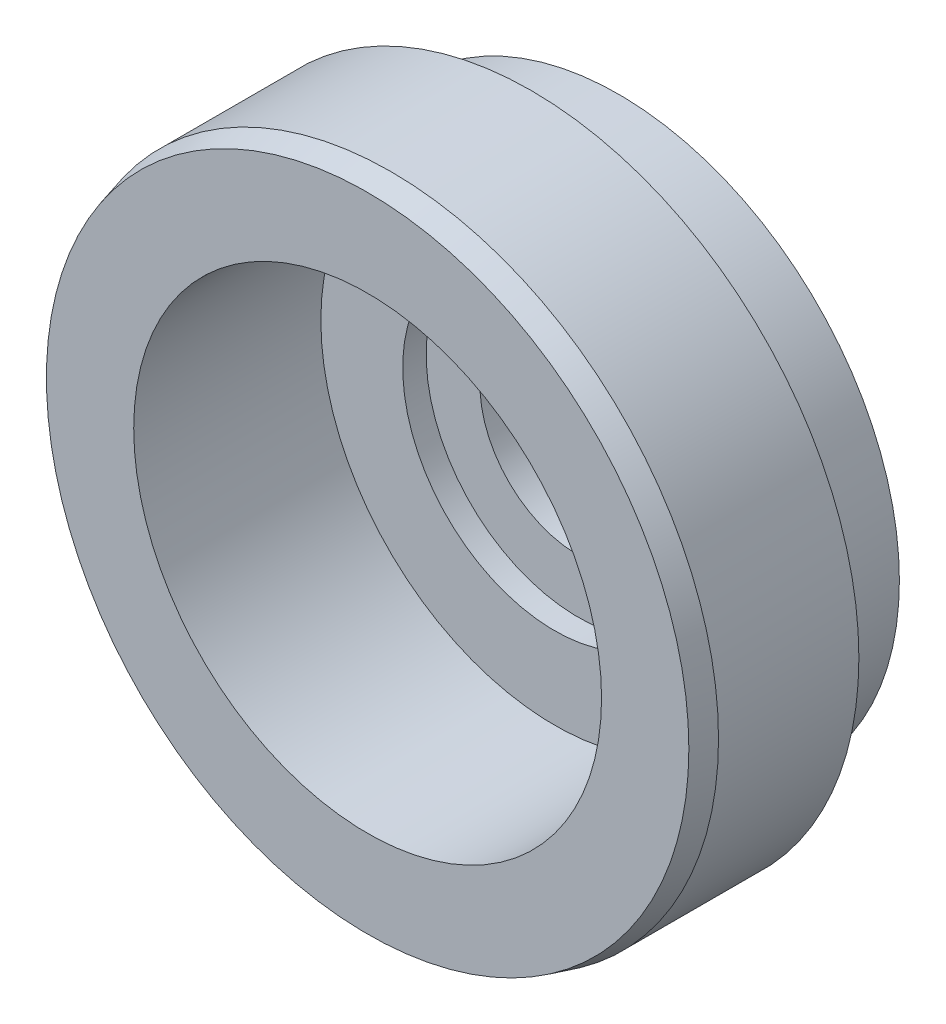
ISO-10303-21;
HEADER;
FILE_DESCRIPTION(('STEP AP214'),'2;1');
FILE_NAME('part.step','',(''),(''),'','','');
FILE_SCHEMA(('AUTOMOTIVE_DESIGN { 1 0 10303 214 1 1 1 1 }'));
ENDSEC;
DATA;
#1=APPLICATION_CONTEXT('core data for automotive mechanical design processes');
#2=APPLICATION_PROTOCOL_DEFINITION('international standard','automotive_design',2000,#1);
#3=PRODUCT_CONTEXT('',#1,'mechanical');
#4=PRODUCT('Part','Part','',(#3));
#5=PRODUCT_RELATED_PRODUCT_CATEGORY('part','',(#4));
#6=PRODUCT_DEFINITION_FORMATION('','',#4);
#7=PRODUCT_DEFINITION_CONTEXT('part definition',#1,'design');
#8=PRODUCT_DEFINITION('design','',#6,#7);
#9=PRODUCT_DEFINITION_SHAPE('','',#8);
#10=(LENGTH_UNIT() NAMED_UNIT(*) SI_UNIT(.MILLI.,.METRE.));
#11=(NAMED_UNIT(*) PLANE_ANGLE_UNIT() SI_UNIT($,.RADIAN.));
#12=(NAMED_UNIT(*) SI_UNIT($,.STERADIAN.) SOLID_ANGLE_UNIT());
#13=UNCERTAINTY_MEASURE_WITH_UNIT(LENGTH_MEASURE(1.E-05),#10,'distance_accuracy_value','');
#14=(GEOMETRIC_REPRESENTATION_CONTEXT(3) GLOBAL_UNCERTAINTY_ASSIGNED_CONTEXT((#13)) GLOBAL_UNIT_ASSIGNED_CONTEXT((#10,
#11,#12)) REPRESENTATION_CONTEXT('',''));
#15=CARTESIAN_POINT('',(0.,0.,0.));
#16=DIRECTION('',(0.,0.,1.));
#17=DIRECTION('',(1.,0.,0.));
#18=AXIS2_PLACEMENT_3D('',#15,#16,#17);
#19=CARTESIAN_POINT('',(0.,0.,2.));
#20=DIRECTION('',(0.,0.,-1.));
#21=DIRECTION('',(-1.,0.,0.));
#22=AXIS2_PLACEMENT_3D('',#19,#20,#21);
#23=CYLINDRICAL_SURFACE('',#22,6.);
#24=CARTESIAN_POINT('',(0.,0.,0.133974596215565));
#25=DIRECTION('',(0.,0.,1.));
#26=DIRECTION('',(1.,0.,0.));
#27=AXIS2_PLACEMENT_3D('',#24,#25,#26);
#28=CIRCLE('',#27,6.);
#29=CARTESIAN_POINT('',(6.,0.,0.133974596215565));
#30=VERTEX_POINT('',#29);
#31=EDGE_CURVE('E43',#30,#30,#28,.T.);
#32=ORIENTED_EDGE('',*,*,#31,.T.);
#33=EDGE_LOOP('',(#32));
#34=FACE_BOUND('',#33,.T.);
#35=CARTESIAN_POINT('',(0.,0.,2.));
#36=DIRECTION('',(0.,0.,1.));
#37=DIRECTION('',(1.,0.,0.));
#38=AXIS2_PLACEMENT_3D('',#35,#36,#37);
#39=CIRCLE('',#38,6.);
#40=CARTESIAN_POINT('',(6.,0.,2.));
#41=VERTEX_POINT('',#40);
#42=EDGE_CURVE('E48',#41,#41,#39,.T.);
#43=ORIENTED_EDGE('',*,*,#42,.F.);
#44=EDGE_LOOP('',(#43));
#45=FACE_BOUND('',#44,.T.);
#46=ADVANCED_FACE('F29',(#34,#45),#23,.T.);
#47=CARTESIAN_POINT('',(0.,0.,0.));
#48=DIRECTION('',(0.,0.,1.));
#49=DIRECTION('',(1.,0.,0.));
#50=AXIS2_PLACEMENT_3D('',#47,#48,#49);
#51=PLANE('',#50);
#52=CARTESIAN_POINT('',(0.,0.,0.));
#53=DIRECTION('',(0.,0.,1.));
#54=DIRECTION('',(1.,0.,0.));
#55=AXIS2_PLACEMENT_3D('',#52,#53,#54);
#56=CIRCLE('',#55,5.5);
#57=CARTESIAN_POINT('',(5.5,0.,0.));
#58=VERTEX_POINT('',#57);
#59=EDGE_CURVE('E39',#58,#58,#56,.F.);
#60=ORIENTED_EDGE('',*,*,#59,.T.);
#61=EDGE_LOOP('',(#60));
#62=FACE_BOUND('',#61,.T.);
#63=CARTESIAN_POINT('',(0.,0.,0.));
#64=DIRECTION('',(0.,0.,1.));
#65=DIRECTION('',(1.,0.,0.));
#66=AXIS2_PLACEMENT_3D('',#63,#64,#65);
#67=CIRCLE('',#66,2.1);
#68=CARTESIAN_POINT('',(2.1,0.,0.));
#69=VERTEX_POINT('',#68);
#70=EDGE_CURVE('E66',#69,#69,#67,.T.);
#71=ORIENTED_EDGE('',*,*,#70,.T.);
#72=EDGE_LOOP('',(#71));
#73=FACE_BOUND('',#72,.T.);
#74=ADVANCED_FACE('F110',(#62,#73),#51,.F.);
#75=CARTESIAN_POINT('',(0.,0.,2.));
#76=DIRECTION('',(0.,0.,1.));
#77=DIRECTION('',(1.,0.,0.));
#78=AXIS2_PLACEMENT_3D('',#75,#76,#77);
#79=PLANE('',#78);
#80=CARTESIAN_POINT('',(0.,0.,2.));
#81=DIRECTION('',(0.,0.,1.));
#82=DIRECTION('',(1.,0.,0.));
#83=AXIS2_PLACEMENT_3D('',#80,#81,#82);
#84=CIRCLE('',#83,7.);
#85=CARTESIAN_POINT('',(7.,0.,2.));
#86=VERTEX_POINT('',#85);
#87=EDGE_CURVE('E51',#86,#86,#84,.T.);
#88=ORIENTED_EDGE('',*,*,#87,.F.);
#89=EDGE_LOOP('',(#88));
#90=FACE_BOUND('',#89,.T.);
#91=ORIENTED_EDGE('',*,*,#42,.T.);
#92=EDGE_LOOP('',(#91));
#93=FACE_BOUND('',#92,.T.);
#94=ADVANCED_FACE('F106',(#90,#93),#79,.F.);
#95=CARTESIAN_POINT('',(0.,0.,5.5));
#96=DIRECTION('',(0.,0.,-1.));
#97=DIRECTION('',(-1.,0.,0.));
#98=AXIS2_PLACEMENT_3D('',#95,#96,#97);
#99=CYLINDRICAL_SURFACE('',#98,7.);
#100=CARTESIAN_POINT('',(0.,0.,5.));
#101=DIRECTION('',(0.,0.,1.));
#102=DIRECTION('',(1.,0.,0.));
#103=AXIS2_PLACEMENT_3D('',#100,#101,#102);
#104=CIRCLE('',#103,7.);
#105=CARTESIAN_POINT('',(7.,0.,5.));
#106=VERTEX_POINT('',#105);
#107=EDGE_CURVE('E10',#106,#106,#104,.F.);
#108=ORIENTED_EDGE('',*,*,#107,.T.);
#109=EDGE_LOOP('',(#108));
#110=FACE_BOUND('',#109,.T.);
#111=ORIENTED_EDGE('',*,*,#87,.T.);
#112=EDGE_LOOP('',(#111));
#113=FACE_BOUND('',#112,.T.);
#114=ADVANCED_FACE('F101',(#110,#113),#99,.T.);
#115=CARTESIAN_POINT('',(0.,0.,5.5));
#116=DIRECTION('',(0.,0.,1.));
#117=DIRECTION('',(1.,0.,0.));
#118=AXIS2_PLACEMENT_3D('',#115,#116,#117);
#119=PLANE('',#118);
#120=CARTESIAN_POINT('',(0.,0.,5.5));
#121=DIRECTION('',(0.,0.,1.));
#122=DIRECTION('',(1.,0.,0.));
#123=AXIS2_PLACEMENT_3D('',#120,#121,#122);
#124=CIRCLE('',#123,6.86602540378443);
#125=CARTESIAN_POINT('',(6.86602540378443,0.,5.5));
#126=VERTEX_POINT('',#125);
#127=EDGE_CURVE('E35',#126,#126,#124,.T.);
#128=ORIENTED_EDGE('',*,*,#127,.T.);
#129=EDGE_LOOP('',(#128));
#130=FACE_BOUND('',#129,.T.);
#131=CARTESIAN_POINT('',(0.,0.,5.5));
#132=DIRECTION('',(0.,0.,1.));
#133=DIRECTION('',(1.,0.,0.));
#134=AXIS2_PLACEMENT_3D('',#131,#132,#133);
#135=CIRCLE('',#134,5.);
#136=CARTESIAN_POINT('',(5.,0.,5.5));
#137=VERTEX_POINT('',#136);
#138=EDGE_CURVE('E57',#137,#137,#135,.T.);
#139=ORIENTED_EDGE('',*,*,#138,.F.);
#140=EDGE_LOOP('',(#139));
#141=FACE_BOUND('',#140,.T.);
#142=ADVANCED_FACE('F96',(#130,#141),#119,.T.);
#143=CARTESIAN_POINT('',(0.,0.,1.5));
#144=DIRECTION('',(0.,0.,1.));
#145=DIRECTION('',(1.,0.,0.));
#146=AXIS2_PLACEMENT_3D('',#143,#144,#145);
#147=CYLINDRICAL_SURFACE('',#146,5.);
#148=CARTESIAN_POINT('',(0.,0.,1.5));
#149=DIRECTION('',(0.,0.,1.));
#150=DIRECTION('',(1.,0.,0.));
#151=AXIS2_PLACEMENT_3D('',#148,#149,#150);
#152=CIRCLE('',#151,5.);
#153=CARTESIAN_POINT('',(5.,0.,1.5));
#154=VERTEX_POINT('',#153);
#155=EDGE_CURVE('E54',#154,#154,#152,.T.);
#156=ORIENTED_EDGE('',*,*,#155,.F.);
#157=EDGE_LOOP('',(#156));
#158=FACE_BOUND('',#157,.T.);
#159=ORIENTED_EDGE('',*,*,#138,.T.);
#160=EDGE_LOOP('',(#159));
#161=FACE_BOUND('',#160,.T.);
#162=ADVANCED_FACE('F90',(#158,#161),#147,.F.);
#163=CARTESIAN_POINT('',(0.,0.,1.5));
#164=DIRECTION('',(0.,0.,1.));
#165=DIRECTION('',(1.,0.,0.));
#166=AXIS2_PLACEMENT_3D('',#163,#164,#165);
#167=PLANE('',#166);
#168=CARTESIAN_POINT('',(0.,0.,1.5));
#169=DIRECTION('',(0.,0.,1.));
#170=DIRECTION('',(1.,0.,0.));
#171=AXIS2_PLACEMENT_3D('',#168,#169,#170);
#172=CIRCLE('',#171,3.25);
#173=CARTESIAN_POINT('',(3.25,0.,1.5));
#174=VERTEX_POINT('',#173);
#175=EDGE_CURVE('E63',#174,#174,#172,.T.);
#176=ORIENTED_EDGE('',*,*,#175,.F.);
#177=EDGE_LOOP('',(#176));
#178=FACE_BOUND('',#177,.T.);
#179=ORIENTED_EDGE('',*,*,#155,.T.);
#180=EDGE_LOOP('',(#179));
#181=FACE_BOUND('',#180,.T.);
#182=ADVANCED_FACE('F84',(#178,#181),#167,.T.);
#183=CARTESIAN_POINT('',(0.,0.,1.));
#184=DIRECTION('',(0.,0.,1.));
#185=DIRECTION('',(1.,0.,0.));
#186=AXIS2_PLACEMENT_3D('',#183,#184,#185);
#187=CYLINDRICAL_SURFACE('',#186,3.25);
#188=CARTESIAN_POINT('',(0.,0.,1.));
#189=DIRECTION('',(0.,0.,1.));
#190=DIRECTION('',(1.,0.,0.));
#191=AXIS2_PLACEMENT_3D('',#188,#189,#190);
#192=CIRCLE('',#191,3.25);
#193=CARTESIAN_POINT('',(3.25,0.,1.));
#194=VERTEX_POINT('',#193);
#195=EDGE_CURVE('E60',#194,#194,#192,.T.);
#196=ORIENTED_EDGE('',*,*,#195,.F.);
#197=EDGE_LOOP('',(#196));
#198=FACE_BOUND('',#197,.T.);
#199=ORIENTED_EDGE('',*,*,#175,.T.);
#200=EDGE_LOOP('',(#199));
#201=FACE_BOUND('',#200,.T.);
#202=ADVANCED_FACE('F78',(#198,#201),#187,.F.);
#203=CARTESIAN_POINT('',(0.,0.,1.));
#204=DIRECTION('',(0.,0.,1.));
#205=DIRECTION('',(1.,0.,0.));
#206=AXIS2_PLACEMENT_3D('',#203,#204,#205);
#207=PLANE('',#206);
#208=CARTESIAN_POINT('',(0.,0.,1.));
#209=DIRECTION('',(0.,0.,1.));
#210=DIRECTION('',(1.,0.,0.));
#211=AXIS2_PLACEMENT_3D('',#208,#209,#210);
#212=CIRCLE('',#211,2.1);
#213=CARTESIAN_POINT('',(2.1,0.,1.));
#214=VERTEX_POINT('',#213);
#215=EDGE_CURVE('E69',#214,#214,#212,.T.);
#216=ORIENTED_EDGE('',*,*,#215,.F.);
#217=EDGE_LOOP('',(#216));
#218=FACE_BOUND('',#217,.T.);
#219=ORIENTED_EDGE('',*,*,#195,.T.);
#220=EDGE_LOOP('',(#219));
#221=FACE_BOUND('',#220,.T.);
#222=ADVANCED_FACE('F75',(#218,#221),#207,.T.);
#223=CARTESIAN_POINT('',(0.,0.,0.));
#224=DIRECTION('',(0.,0.,1.));
#225=DIRECTION('',(1.,0.,0.));
#226=AXIS2_PLACEMENT_3D('',#223,#224,#225);
#227=CYLINDRICAL_SURFACE('',#226,2.1);
#228=ORIENTED_EDGE('',*,*,#70,.F.);
#229=EDGE_LOOP('',(#228));
#230=FACE_BOUND('',#229,.T.);
#231=ORIENTED_EDGE('',*,*,#215,.T.);
#232=EDGE_LOOP('',(#231));
#233=FACE_BOUND('',#232,.T.);
#234=ADVANCED_FACE('F73',(#230,#233),#227,.F.);
#235=CARTESIAN_POINT('',(0.,0.,0.133974596215565));
#236=DIRECTION('',(0.,0.,1.));
#237=DIRECTION('',(1.,0.,0.));
#238=AXIS2_PLACEMENT_3D('',#235,#236,#237);
#239=CONICAL_SURFACE('',#238,6.,1.30899693899574);
#240=ORIENTED_EDGE('',*,*,#59,.F.);
#241=EDGE_LOOP('',(#240));
#242=FACE_BOUND('',#241,.T.);
#243=ORIENTED_EDGE('',*,*,#31,.F.);
#244=EDGE_LOOP('',(#243));
#245=FACE_BOUND('',#244,.T.);
#246=ADVANCED_FACE('F128',(#242,#245),#239,.T.);
#247=CARTESIAN_POINT('',(0.,0.,5.5));
#248=DIRECTION('',(0.,0.,-1.));
#249=DIRECTION('',(-1.,0.,0.));
#250=AXIS2_PLACEMENT_3D('',#247,#248,#249);
#251=CONICAL_SURFACE('',#250,6.86602540378443,0.261799387799157);
#252=ORIENTED_EDGE('',*,*,#107,.F.);
#253=EDGE_LOOP('',(#252));
#254=FACE_BOUND('',#253,.T.);
#255=ORIENTED_EDGE('',*,*,#127,.F.);
#256=EDGE_LOOP('',(#255));
#257=FACE_BOUND('',#256,.T.);
#258=ADVANCED_FACE('F132',(#254,#257),#251,.T.);
#259=CLOSED_SHELL('',(#46,#74,#94,#114,#142,#162,#182,#202,#222,#234,#246,#258));
#260=MANIFOLD_SOLID_BREP('B2',#259);
#261=ADVANCED_BREP_SHAPE_REPRESENTATION('',(#18,#260),#14);
#262=SHAPE_DEFINITION_REPRESENTATION(#9,#261);
ENDSEC;
END-ISO-10303-21;
